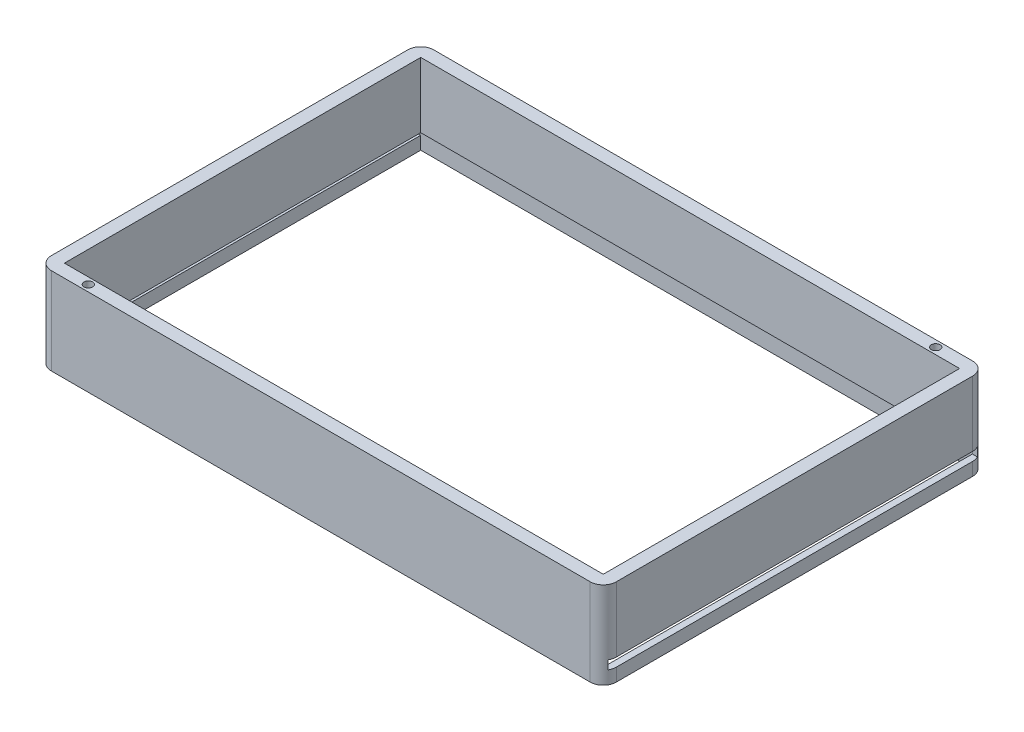
ISO-10303-21;
HEADER;
FILE_DESCRIPTION(('STEP AP214'),'2;1');
FILE_NAME('part.step','',(''),(''),'','','');
FILE_SCHEMA(('AUTOMOTIVE_DESIGN { 1 0 10303 214 1 1 1 1 }'));
ENDSEC;
DATA;
#1=APPLICATION_CONTEXT('core data for automotive mechanical design processes');
#2=APPLICATION_PROTOCOL_DEFINITION('international standard','automotive_design',2000,#1);
#3=PRODUCT_CONTEXT('',#1,'mechanical');
#4=PRODUCT('Part','Part','',(#3));
#5=PRODUCT_RELATED_PRODUCT_CATEGORY('part','',(#4));
#6=PRODUCT_DEFINITION_FORMATION('','',#4);
#7=PRODUCT_DEFINITION_CONTEXT('part definition',#1,'design');
#8=PRODUCT_DEFINITION('design','',#6,#7);
#9=PRODUCT_DEFINITION_SHAPE('','',#8);
#10=(LENGTH_UNIT() NAMED_UNIT(*) SI_UNIT(.MILLI.,.METRE.));
#11=(NAMED_UNIT(*) PLANE_ANGLE_UNIT() SI_UNIT($,.RADIAN.));
#12=(NAMED_UNIT(*) SI_UNIT($,.STERADIAN.) SOLID_ANGLE_UNIT());
#13=UNCERTAINTY_MEASURE_WITH_UNIT(LENGTH_MEASURE(1.E-05),#10,'distance_accuracy_value','');
#14=(GEOMETRIC_REPRESENTATION_CONTEXT(3) GLOBAL_UNCERTAINTY_ASSIGNED_CONTEXT((#13)) GLOBAL_UNIT_ASSIGNED_CONTEXT((#10,
#11,#12)) REPRESENTATION_CONTEXT('',''));
#15=CARTESIAN_POINT('',(0.,0.,0.));
#16=DIRECTION('',(0.,0.,1.));
#17=DIRECTION('',(1.,0.,0.));
#18=AXIS2_PLACEMENT_3D('',#15,#16,#17);
#19=CARTESIAN_POINT('',(130.,20.0000000000001,-3.00000000000002));
#20=DIRECTION('',(-1.,0.,0.));
#21=DIRECTION('',(0.,0.,1.));
#22=AXIS2_PLACEMENT_3D('',#19,#20,#21);
#23=PLANE('',#22);
#24=DIRECTION('',(0.,0.,-1.));
#25=VECTOR('',#24,1.);
#26=CARTESIAN_POINT('',(130.,2.98767595815253,-3.00000000000002));
#27=LINE('',#26,#25);
#28=CARTESIAN_POINT('',(130.,2.98767595815253,-3.00000000000002));
#29=VERTEX_POINT('',#28);
#30=CARTESIAN_POINT('',(130.,2.98767595815252,-85.));
#31=VERTEX_POINT('',#30);
#32=EDGE_CURVE('E570',#29,#31,#27,.T.);
#33=ORIENTED_EDGE('',*,*,#32,.F.);
#34=DIRECTION('',(0.,-1.,0.));
#35=VECTOR('',#34,1.);
#36=CARTESIAN_POINT('',(130.,20.0000000000001,-3.00000000000002));
#37=LINE('',#36,#35);
#38=CARTESIAN_POINT('',(130.,0.,-3.00000000000002));
#39=VERTEX_POINT('',#38);
#40=EDGE_CURVE('E452',#29,#39,#37,.T.);
#41=ORIENTED_EDGE('',*,*,#40,.T.);
#42=DIRECTION('',(0.,0.,-1.));
#43=VECTOR('',#42,1.);
#44=CARTESIAN_POINT('',(130.,0.,-3.00000000000002));
#45=LINE('',#44,#43);
#46=CARTESIAN_POINT('',(130.,0.,-85.));
#47=VERTEX_POINT('',#46);
#48=EDGE_CURVE('E425',#39,#47,#45,.T.);
#49=ORIENTED_EDGE('',*,*,#48,.T.);
#50=DIRECTION('',(0.,-1.,0.));
#51=VECTOR('',#50,1.);
#52=CARTESIAN_POINT('',(130.,20.0000000000001,-85.));
#53=LINE('',#52,#51);
#54=EDGE_CURVE('E450',#31,#47,#53,.T.);
#55=ORIENTED_EDGE('',*,*,#54,.F.);
#56=EDGE_LOOP('',(#33,#41,#49,#55));
#57=FACE_BOUND('',#56,.T.);
#58=ADVANCED_FACE('F32',(#57),#23,.F.);
#59=CARTESIAN_POINT('',(0.,20.0000000000001,-3.00000000000002));
#60=DIRECTION('',(1.,0.,0.));
#61=DIRECTION('',(0.,0.,-1.));
#62=AXIS2_PLACEMENT_3D('',#59,#60,#61);
#63=PLANE('',#62);
#64=DIRECTION('',(0.,0.,-1.));
#65=VECTOR('',#64,1.);
#66=CARTESIAN_POINT('',(0.,2.98767595815253,-1.49220309670284));
#67=LINE('',#66,#65);
#68=CARTESIAN_POINT('',(0.,2.98767595815253,-3.00000000000002));
#69=VERTEX_POINT('',#68);
#70=CARTESIAN_POINT('',(0.,2.98767595815252,-85.));
#71=VERTEX_POINT('',#70);
#72=EDGE_CURVE('E526',#69,#71,#67,.T.);
#73=ORIENTED_EDGE('',*,*,#72,.T.);
#74=DIRECTION('',(0.,-1.,0.));
#75=VECTOR('',#74,1.);
#76=CARTESIAN_POINT('',(0.,20.0000000000001,-85.));
#77=LINE('',#76,#75);
#78=CARTESIAN_POINT('',(0.,0.,-85.));
#79=VERTEX_POINT('',#78);
#80=EDGE_CURVE('E440',#71,#79,#77,.T.);
#81=ORIENTED_EDGE('',*,*,#80,.T.);
#82=DIRECTION('',(0.,0.,1.));
#83=VECTOR('',#82,1.);
#84=CARTESIAN_POINT('',(0.,0.,-3.00000000000002));
#85=LINE('',#84,#83);
#86=CARTESIAN_POINT('',(0.,0.,-3.00000000000002));
#87=VERTEX_POINT('',#86);
#88=EDGE_CURVE('E403',#79,#87,#85,.T.);
#89=ORIENTED_EDGE('',*,*,#88,.T.);
#90=DIRECTION('',(0.,-1.,0.));
#91=VECTOR('',#90,1.);
#92=CARTESIAN_POINT('',(0.,20.0000000000001,-3.00000000000002));
#93=LINE('',#92,#91);
#94=EDGE_CURVE('E417',#69,#87,#93,.T.);
#95=ORIENTED_EDGE('',*,*,#94,.F.);
#96=EDGE_LOOP('',(#73,#81,#89,#95));
#97=FACE_BOUND('',#96,.T.);
#98=ADVANCED_FACE('F562',(#97),#63,.F.);
#99=CARTESIAN_POINT('',(1.5,5.00000000000005,-1.5));
#100=DIRECTION('',(0.,0.,1.));
#101=DIRECTION('',(1.,0.,0.));
#102=AXIS2_PLACEMENT_3D('',#99,#100,#101);
#103=PLANE('',#102);
#104=DIRECTION('',(-1.,0.,0.));
#105=VECTOR('',#104,1.);
#106=CARTESIAN_POINT('',(1.5,2.98767595815253,-1.5));
#107=LINE('',#106,#105);
#108=CARTESIAN_POINT('',(9.,2.98767595815253,-1.5));
#109=VERTEX_POINT('',#108);
#110=CARTESIAN_POINT('',(1.5,2.98767595815253,-1.5));
#111=VERTEX_POINT('',#110);
#112=EDGE_CURVE('E505',#109,#111,#107,.T.);
#113=ORIENTED_EDGE('',*,*,#112,.F.);
#114=DIRECTION('',(0.,-1.,0.));
#115=VECTOR('',#114,1.);
#116=CARTESIAN_POINT('',(9.,20.0000000000001,-1.5));
#117=LINE('',#116,#115);
#118=CARTESIAN_POINT('',(9.,0.,-1.5));
#119=VERTEX_POINT('',#118);
#120=EDGE_CURVE('E469',#109,#119,#117,.T.);
#121=ORIENTED_EDGE('',*,*,#120,.T.);
#122=DIRECTION('',(-1.,0.,0.));
#123=VECTOR('',#122,1.);
#124=CARTESIAN_POINT('',(1.5,0.,-1.5));
#125=LINE('',#124,#123);
#126=CARTESIAN_POINT('',(1.5,0.,-1.5));
#127=VERTEX_POINT('',#126);
#128=EDGE_CURVE('E336',#119,#127,#125,.T.);
#129=ORIENTED_EDGE('',*,*,#128,.T.);
#130=DIRECTION('',(0.,-1.,0.));
#131=VECTOR('',#130,1.);
#132=CARTESIAN_POINT('',(1.5,5.00000000000005,-1.5));
#133=LINE('',#132,#131);
#134=EDGE_CURVE('E342',#111,#127,#133,.T.);
#135=ORIENTED_EDGE('',*,*,#134,.F.);
#136=EDGE_LOOP('',(#113,#121,#129,#135));
#137=FACE_BOUND('',#136,.T.);
#138=ADVANCED_FACE('F620',(#137),#103,.F.);
#139=DIRECTION('',(-1.,0.,0.));
#140=VECTOR('',#139,1.);
#141=CARTESIAN_POINT('',(1.5,2.98767595815253,-1.5));
#142=LINE('',#141,#140);
#143=CARTESIAN_POINT('',(128.5,2.98767595815253,-1.49999999999998));
#144=VERTEX_POINT('',#143);
#145=CARTESIAN_POINT('',(11.,2.98767595815253,-1.5));
#146=VERTEX_POINT('',#145);
#147=EDGE_CURVE('E271',#144,#146,#142,.T.);
#148=ORIENTED_EDGE('',*,*,#147,.F.);
#149=DIRECTION('',(0.,-1.,0.));
#150=VECTOR('',#149,1.);
#151=CARTESIAN_POINT('',(128.5,5.00000000000005,-1.49999999999998));
#152=LINE('',#151,#150);
#153=CARTESIAN_POINT('',(128.5,0.,-1.49999999999998));
#154=VERTEX_POINT('',#153);
#155=EDGE_CURVE('E346',#144,#154,#152,.T.);
#156=ORIENTED_EDGE('',*,*,#155,.T.);
#157=CARTESIAN_POINT('',(11.,0.,-1.5));
#158=VERTEX_POINT('',#157);
#159=EDGE_CURVE('E316',#154,#158,#125,.T.);
#160=ORIENTED_EDGE('',*,*,#159,.T.);
#161=DIRECTION('',(0.,-1.,0.));
#162=VECTOR('',#161,1.);
#163=CARTESIAN_POINT('',(11.,20.0000000000001,-1.5));
#164=LINE('',#163,#162);
#165=EDGE_CURVE('E466',#158,#146,#164,.F.);
#166=ORIENTED_EDGE('',*,*,#165,.T.);
#167=EDGE_LOOP('',(#148,#156,#160,#166));
#168=FACE_BOUND('',#167,.T.);
#169=ADVANCED_FACE('F686',(#168),#103,.F.);
#170=CARTESIAN_POINT('',(3.,20.0000000000001,-3.));
#171=DIRECTION('',(1.,0.,0.));
#172=DIRECTION('',(0.,0.,-1.));
#173=AXIS2_PLACEMENT_3D('',#170,#171,#172);
#174=PLANE('',#173);
#175=DIRECTION('',(0.,-1.,0.));
#176=VECTOR('',#175,1.);
#177=CARTESIAN_POINT('',(3.,20.0000000000001,-3.));
#178=LINE('',#177,#176);
#179=CARTESIAN_POINT('',(3.,20.0000000000001,-3.));
#180=VERTEX_POINT('',#179);
#181=CARTESIAN_POINT('',(3.,5.00000000000005,-3.));
#182=VERTEX_POINT('',#181);
#183=EDGE_CURVE('E395',#180,#182,#178,.T.);
#184=ORIENTED_EDGE('',*,*,#183,.T.);
#185=DIRECTION('',(0.,0.,-1.));
#186=VECTOR('',#185,1.);
#187=CARTESIAN_POINT('',(3.,5.00000000000005,-3.));
#188=LINE('',#187,#186);
#189=CARTESIAN_POINT('',(3.,5.00000000000005,-85.));
#190=VERTEX_POINT('',#189);
#191=EDGE_CURVE('E362',#182,#190,#188,.T.);
#192=ORIENTED_EDGE('',*,*,#191,.T.);
#193=DIRECTION('',(0.,-1.,0.));
#194=VECTOR('',#193,1.);
#195=CARTESIAN_POINT('',(3.,20.0000000000001,-85.));
#196=LINE('',#195,#194);
#197=CARTESIAN_POINT('',(3.,20.0000000000001,-85.));
#198=VERTEX_POINT('',#197);
#199=EDGE_CURVE('E386',#198,#190,#196,.T.);
#200=ORIENTED_EDGE('',*,*,#199,.F.);
#201=DIRECTION('',(0.,0.,1.));
#202=VECTOR('',#201,1.);
#203=CARTESIAN_POINT('',(3.,20.0000000000001,-3.));
#204=LINE('',#203,#202);
#205=EDGE_CURVE('E375',#198,#180,#204,.T.);
#206=ORIENTED_EDGE('',*,*,#205,.T.);
#207=EDGE_LOOP('',(#184,#192,#200,#206));
#208=FACE_BOUND('',#207,.T.);
#209=ADVANCED_FACE('F683',(#208),#174,.T.);
#210=CARTESIAN_POINT('',(3.,20.0000000000001,-3.));
#211=DIRECTION('',(0.,0.,-1.));
#212=DIRECTION('',(-1.,0.,0.));
#213=AXIS2_PLACEMENT_3D('',#210,#211,#212);
#214=PLANE('',#213);
#215=DIRECTION('',(0.,-1.,0.));
#216=VECTOR('',#215,1.);
#217=CARTESIAN_POINT('',(127.,20.0000000000001,-3.));
#218=LINE('',#217,#216);
#219=CARTESIAN_POINT('',(127.,20.0000000000001,-3.));
#220=VERTEX_POINT('',#219);
#221=CARTESIAN_POINT('',(127.,5.00000000000005,-3.));
#222=VERTEX_POINT('',#221);
#223=EDGE_CURVE('E392',#220,#222,#218,.T.);
#224=ORIENTED_EDGE('',*,*,#223,.T.);
#225=DIRECTION('',(-1.,0.,0.));
#226=VECTOR('',#225,1.);
#227=CARTESIAN_POINT('',(3.,5.00000000000005,-3.));
#228=LINE('',#227,#226);
#229=EDGE_CURVE('E359',#222,#182,#228,.T.);
#230=ORIENTED_EDGE('',*,*,#229,.T.);
#231=ORIENTED_EDGE('',*,*,#183,.F.);
#232=DIRECTION('',(1.,0.,0.));
#233=VECTOR('',#232,1.);
#234=CARTESIAN_POINT('',(3.,20.0000000000001,-3.));
#235=LINE('',#234,#233);
#236=EDGE_CURVE('E379',#180,#220,#235,.T.);
#237=ORIENTED_EDGE('',*,*,#236,.T.);
#238=EDGE_LOOP('',(#224,#230,#231,#237));
#239=FACE_BOUND('',#238,.T.);
#240=ADVANCED_FACE('F680',(#239),#214,.T.);
#241=CARTESIAN_POINT('',(127.,20.0000000000001,-3.));
#242=DIRECTION('',(-1.,0.,0.));
#243=DIRECTION('',(0.,0.,1.));
#244=AXIS2_PLACEMENT_3D('',#241,#242,#243);
#245=PLANE('',#244);
#246=DIRECTION('',(0.,-1.,0.));
#247=VECTOR('',#246,1.);
#248=CARTESIAN_POINT('',(127.,20.0000000000001,-85.));
#249=LINE('',#248,#247);
#250=CARTESIAN_POINT('',(127.,20.0000000000001,-85.));
#251=VERTEX_POINT('',#250);
#252=CARTESIAN_POINT('',(127.,5.00000000000005,-85.));
#253=VERTEX_POINT('',#252);
#254=EDGE_CURVE('E389',#251,#253,#249,.T.);
#255=ORIENTED_EDGE('',*,*,#254,.T.);
#256=DIRECTION('',(0.,0.,1.));
#257=VECTOR('',#256,1.);
#258=CARTESIAN_POINT('',(127.,5.00000000000005,-3.));
#259=LINE('',#258,#257);
#260=EDGE_CURVE('E356',#253,#222,#259,.T.);
#261=ORIENTED_EDGE('',*,*,#260,.T.);
#262=ORIENTED_EDGE('',*,*,#223,.F.);
#263=DIRECTION('',(0.,0.,-1.));
#264=VECTOR('',#263,1.);
#265=CARTESIAN_POINT('',(127.,20.0000000000001,-3.));
#266=LINE('',#265,#264);
#267=EDGE_CURVE('E381',#220,#251,#266,.T.);
#268=ORIENTED_EDGE('',*,*,#267,.T.);
#269=EDGE_LOOP('',(#255,#261,#262,#268));
#270=FACE_BOUND('',#269,.T.);
#271=ADVANCED_FACE('F676',(#270),#245,.T.);
#272=CARTESIAN_POINT('',(3.,20.0000000000001,-85.));
#273=DIRECTION('',(0.,0.,1.));
#274=DIRECTION('',(1.,0.,0.));
#275=AXIS2_PLACEMENT_3D('',#272,#273,#274);
#276=PLANE('',#275);
#277=ORIENTED_EDGE('',*,*,#199,.T.);
#278=DIRECTION('',(1.,0.,0.));
#279=VECTOR('',#278,1.);
#280=CARTESIAN_POINT('',(3.,5.00000000000005,-85.));
#281=LINE('',#280,#279);
#282=EDGE_CURVE('E353',#190,#253,#281,.T.);
#283=ORIENTED_EDGE('',*,*,#282,.T.);
#284=ORIENTED_EDGE('',*,*,#254,.F.);
#285=DIRECTION('',(-1.,0.,0.));
#286=VECTOR('',#285,1.);
#287=CARTESIAN_POINT('',(3.,20.0000000000001,-85.));
#288=LINE('',#287,#286);
#289=EDGE_CURVE('E384',#251,#198,#288,.T.);
#290=ORIENTED_EDGE('',*,*,#289,.T.);
#291=EDGE_LOOP('',(#277,#283,#284,#290));
#292=FACE_BOUND('',#291,.T.);
#293=ADVANCED_FACE('F654',(#292),#276,.T.);
#294=CARTESIAN_POINT('',(3.,20.0000000000001,-3.));
#295=DIRECTION('',(0.,-1.,0.));
#296=DIRECTION('',(0.,0.,-1.));
#297=AXIS2_PLACEMENT_3D('',#294,#295,#296);
#298=PLANE('',#297);
#299=CARTESIAN_POINT('',(3.,20.0000000000001,-3.));
#300=DIRECTION('',(0.,1.,0.));
#301=DIRECTION('',(0.,0.,-1.));
#302=AXIS2_PLACEMENT_3D('',#299,#300,#301);
#303=CIRCLE('',#302,3.);
#304=CARTESIAN_POINT('',(0.,20.0000000000001,-3.00000000000002));
#305=VERTEX_POINT('',#304);
#306=CARTESIAN_POINT('',(3.00000000000002,20.0000000000001,0.));
#307=VERTEX_POINT('',#306);
#308=EDGE_CURVE('E399',#305,#307,#303,.T.);
#309=ORIENTED_EDGE('',*,*,#308,.T.);
#310=DIRECTION('',(1.,0.,0.));
#311=VECTOR('',#310,1.);
#312=CARTESIAN_POINT('',(3.00000000000002,20.0000000000001,0.));
#313=LINE('',#312,#311);
#314=CARTESIAN_POINT('',(127.,20.0000000000001,0.));
#315=VERTEX_POINT('',#314);
#316=EDGE_CURVE('E402',#307,#315,#313,.T.);
#317=ORIENTED_EDGE('',*,*,#316,.T.);
#318=CARTESIAN_POINT('',(127.,20.0000000000001,-3.));
#319=DIRECTION('',(0.,1.,0.));
#320=DIRECTION('',(0.,0.,1.));
#321=AXIS2_PLACEMENT_3D('',#318,#319,#320);
#322=CIRCLE('',#321,3.);
#323=CARTESIAN_POINT('',(130.,20.0000000000001,-3.00000000000002));
#324=VERTEX_POINT('',#323);
#325=EDGE_CURVE('E405',#315,#324,#322,.T.);
#326=ORIENTED_EDGE('',*,*,#325,.T.);
#327=DIRECTION('',(0.,0.,-1.));
#328=VECTOR('',#327,1.);
#329=CARTESIAN_POINT('',(130.,20.0000000000001,-3.00000000000002));
#330=LINE('',#329,#328);
#331=CARTESIAN_POINT('',(130.,20.0000000000001,-85.));
#332=VERTEX_POINT('',#331);
#333=EDGE_CURVE('E407',#324,#332,#330,.T.);
#334=ORIENTED_EDGE('',*,*,#333,.T.);
#335=CARTESIAN_POINT('',(127.,20.0000000000001,-85.));
#336=DIRECTION('',(0.,1.,0.));
#337=DIRECTION('',(0.,0.,-1.));
#338=AXIS2_PLACEMENT_3D('',#335,#336,#337);
#339=CIRCLE('',#338,3.);
#340=CARTESIAN_POINT('',(127.,20.0000000000001,-88.));
#341=VERTEX_POINT('',#340);
#342=EDGE_CURVE('E409',#332,#341,#339,.T.);
#343=ORIENTED_EDGE('',*,*,#342,.T.);
#344=DIRECTION('',(-1.,0.,0.));
#345=VECTOR('',#344,1.);
#346=CARTESIAN_POINT('',(3.00000000000002,20.0000000000001,-88.));
#347=LINE('',#346,#345);
#348=CARTESIAN_POINT('',(3.00000000000002,20.0000000000001,-88.));
#349=VERTEX_POINT('',#348);
#350=EDGE_CURVE('E411',#341,#349,#347,.T.);
#351=ORIENTED_EDGE('',*,*,#350,.T.);
#352=CARTESIAN_POINT('',(3.,20.0000000000001,-85.));
#353=DIRECTION('',(0.,1.,0.));
#354=DIRECTION('',(0.,0.,-1.));
#355=AXIS2_PLACEMENT_3D('',#352,#353,#354);
#356=CIRCLE('',#355,3.);
#357=CARTESIAN_POINT('',(0.,20.0000000000001,-85.));
#358=VERTEX_POINT('',#357);
#359=EDGE_CURVE('E413',#349,#358,#356,.T.);
#360=ORIENTED_EDGE('',*,*,#359,.T.);
#361=DIRECTION('',(0.,0.,1.));
#362=VECTOR('',#361,1.);
#363=CARTESIAN_POINT('',(0.,20.0000000000001,-3.00000000000002));
#364=LINE('',#363,#362);
#365=EDGE_CURVE('E415',#358,#305,#364,.T.);
#366=ORIENTED_EDGE('',*,*,#365,.T.);
#367=EDGE_LOOP('',(#309,#317,#326,#334,#343,#351,#360,#366));
#368=FACE_BOUND('',#367,.T.);
#369=ORIENTED_EDGE('',*,*,#205,.F.);
#370=ORIENTED_EDGE('',*,*,#289,.F.);
#371=ORIENTED_EDGE('',*,*,#267,.F.);
#372=ORIENTED_EDGE('',*,*,#236,.F.);
#373=EDGE_LOOP('',(#369,#370,#371,#372));
#374=FACE_BOUND('',#373,.T.);
#375=CARTESIAN_POINT('',(120.,20.0000000000001,-86.5));
#376=DIRECTION('',(0.,1.,0.));
#377=DIRECTION('',(0.,0.,1.));
#378=AXIS2_PLACEMENT_3D('',#375,#376,#377);
#379=CIRCLE('',#378,0.999999999999998);
#380=CARTESIAN_POINT('',(120.,20.0000000000001,-85.5));
#381=VERTEX_POINT('',#380);
#382=EDGE_CURVE('E372',#381,#381,#379,.T.);
#383=ORIENTED_EDGE('',*,*,#382,.F.);
#384=EDGE_LOOP('',(#383));
#385=FACE_BOUND('',#384,.T.);
#386=CARTESIAN_POINT('',(10.,20.0000000000001,-1.5));
#387=DIRECTION('',(0.,1.,0.));
#388=DIRECTION('',(0.,0.,1.));
#389=AXIS2_PLACEMENT_3D('',#386,#387,#388);
#390=CIRCLE('',#389,1.);
#391=CARTESIAN_POINT('',(10.,20.0000000000001,-0.499999999999999));
#392=VERTEX_POINT('',#391);
#393=EDGE_CURVE('E366',#392,#392,#390,.T.);
#394=ORIENTED_EDGE('',*,*,#393,.F.);
#395=EDGE_LOOP('',(#394));
#396=FACE_BOUND('',#395,.T.);
#397=ADVANCED_FACE('F546',(#368,#374,#385,#396),#298,.F.);
#398=CARTESIAN_POINT('',(3.,0.,-3.));
#399=DIRECTION('',(0.,-1.,0.));
#400=DIRECTION('',(0.,0.,-1.));
#401=AXIS2_PLACEMENT_3D('',#398,#399,#400);
#402=PLANE('',#401);
#403=ORIENTED_EDGE('',*,*,#128,.F.);
#404=CARTESIAN_POINT('',(10.,0.,-1.5));
#405=DIRECTION('',(0.,1.,0.));
#406=DIRECTION('',(0.,0.,1.));
#407=AXIS2_PLACEMENT_3D('',#404,#405,#406);
#408=CIRCLE('',#407,1.);
#409=EDGE_CURVE('E365',#119,#158,#408,.T.);
#410=ORIENTED_EDGE('',*,*,#409,.T.);
#411=ORIENTED_EDGE('',*,*,#159,.F.);
#412=DIRECTION('',(0.,0.,1.));
#413=VECTOR('',#412,1.);
#414=CARTESIAN_POINT('',(128.5,0.,-1.49999999999998));
#415=LINE('',#414,#413);
#416=CARTESIAN_POINT('',(128.5,0.,-86.5));
#417=VERTEX_POINT('',#416);
#418=EDGE_CURVE('E333',#417,#154,#415,.T.);
#419=ORIENTED_EDGE('',*,*,#418,.F.);
#420=DIRECTION('',(1.,0.,0.));
#421=VECTOR('',#420,1.);
#422=CARTESIAN_POINT('',(1.5,0.,-86.5));
#423=LINE('',#422,#421);
#424=CARTESIAN_POINT('',(121.,0.,-86.5));
#425=VERTEX_POINT('',#424);
#426=EDGE_CURVE('E330',#425,#417,#423,.T.);
#427=ORIENTED_EDGE('',*,*,#426,.F.);
#428=CARTESIAN_POINT('',(120.,0.,-86.5));
#429=DIRECTION('',(0.,1.,0.));
#430=DIRECTION('',(0.,0.,1.));
#431=AXIS2_PLACEMENT_3D('',#428,#429,#430);
#432=CIRCLE('',#431,0.999999999999998);
#433=CARTESIAN_POINT('',(119.,0.,-86.5));
#434=VERTEX_POINT('',#433);
#435=EDGE_CURVE('E369',#425,#434,#432,.T.);
#436=ORIENTED_EDGE('',*,*,#435,.T.);
#437=CARTESIAN_POINT('',(1.5,0.,-86.5));
#438=VERTEX_POINT('',#437);
#439=EDGE_CURVE('E331',#438,#434,#423,.T.);
#440=ORIENTED_EDGE('',*,*,#439,.F.);
#441=DIRECTION('',(0.,0.,-1.));
#442=VECTOR('',#441,1.);
#443=CARTESIAN_POINT('',(1.5,0.,-1.5));
#444=LINE('',#443,#442);
#445=EDGE_CURVE('E311',#127,#438,#444,.T.);
#446=ORIENTED_EDGE('',*,*,#445,.F.);
#447=EDGE_LOOP('',(#403,#410,#411,#419,#427,#436,#440,#446));
#448=FACE_BOUND('',#447,.T.);
#449=CARTESIAN_POINT('',(3.,0.,-3.));
#450=DIRECTION('',(0.,1.,0.));
#451=DIRECTION('',(0.,0.,-1.));
#452=AXIS2_PLACEMENT_3D('',#449,#450,#451);
#453=CIRCLE('',#452,3.);
#454=CARTESIAN_POINT('',(3.00000000000002,0.,0.));
#455=VERTEX_POINT('',#454);
#456=EDGE_CURVE('E398',#87,#455,#453,.T.);
#457=ORIENTED_EDGE('',*,*,#456,.F.);
#458=ORIENTED_EDGE('',*,*,#88,.F.);
#459=CARTESIAN_POINT('',(3.,0.,-85.));
#460=DIRECTION('',(0.,1.,0.));
#461=DIRECTION('',(0.,0.,-1.));
#462=AXIS2_PLACEMENT_3D('',#459,#460,#461);
#463=CIRCLE('',#462,3.);
#464=CARTESIAN_POINT('',(3.00000000000002,0.,-88.));
#465=VERTEX_POINT('',#464);
#466=EDGE_CURVE('E432',#465,#79,#463,.T.);
#467=ORIENTED_EDGE('',*,*,#466,.F.);
#468=DIRECTION('',(-1.,0.,0.));
#469=VECTOR('',#468,1.);
#470=CARTESIAN_POINT('',(3.00000000000002,0.,-88.));
#471=LINE('',#470,#469);
#472=CARTESIAN_POINT('',(127.,0.,-88.));
#473=VERTEX_POINT('',#472);
#474=EDGE_CURVE('E430',#473,#465,#471,.T.);
#475=ORIENTED_EDGE('',*,*,#474,.F.);
#476=CARTESIAN_POINT('',(127.,0.,-85.));
#477=DIRECTION('',(0.,1.,0.));
#478=DIRECTION('',(0.,0.,-1.));
#479=AXIS2_PLACEMENT_3D('',#476,#477,#478);
#480=CIRCLE('',#479,3.);
#481=EDGE_CURVE('E428',#47,#473,#480,.T.);
#482=ORIENTED_EDGE('',*,*,#481,.F.);
#483=ORIENTED_EDGE('',*,*,#48,.F.);
#484=CARTESIAN_POINT('',(127.,0.,-3.));
#485=DIRECTION('',(0.,1.,0.));
#486=DIRECTION('',(0.,0.,1.));
#487=AXIS2_PLACEMENT_3D('',#484,#485,#486);
#488=CIRCLE('',#487,3.);
#489=CARTESIAN_POINT('',(127.,0.,0.));
#490=VERTEX_POINT('',#489);
#491=EDGE_CURVE('E422',#490,#39,#488,.T.);
#492=ORIENTED_EDGE('',*,*,#491,.F.);
#493=DIRECTION('',(1.,0.,0.));
#494=VECTOR('',#493,1.);
#495=CARTESIAN_POINT('',(3.00000000000002,0.,0.));
#496=LINE('',#495,#494);
#497=EDGE_CURVE('E420',#455,#490,#496,.T.);
#498=ORIENTED_EDGE('',*,*,#497,.F.);
#499=EDGE_LOOP('',(#457,#458,#467,#475,#482,#483,#492,#498));
#500=FACE_BOUND('',#499,.T.);
#501=ADVANCED_FACE('F558',(#448,#500),#402,.T.);
#502=CARTESIAN_POINT('',(3.,20.0000000000001,-3.));
#503=DIRECTION('',(0.,-1.,0.));
#504=DIRECTION('',(0.,0.,-1.));
#505=AXIS2_PLACEMENT_3D('',#502,#503,#504);
#506=CYLINDRICAL_SURFACE('',#505,3.);
#507=CARTESIAN_POINT('',(0.,4.98767595815252,-3.00000000000002));
#508=VERTEX_POINT('',#507);
#509=EDGE_CURVE('E437',#305,#508,#93,.T.);
#510=ORIENTED_EDGE('',*,*,#509,.T.);
#511=CARTESIAN_POINT('',(3.,4.98767595815252,-3.));
#512=DIRECTION('',(0.,1.,0.));
#513=DIRECTION('',(0.,0.,1.));
#514=AXIS2_PLACEMENT_3D('',#511,#512,#513);
#515=CIRCLE('',#514,3.);
#516=CARTESIAN_POINT('',(0.406440959143689,4.98767595815252,-1.49220309670284));
#517=VERTEX_POINT('',#516);
#518=EDGE_CURVE('E302',#508,#517,#515,.T.);
#519=ORIENTED_EDGE('',*,*,#518,.T.);
#520=DIRECTION('',(0.,-1.,0.));
#521=VECTOR('',#520,1.);
#522=CARTESIAN_POINT('',(0.406440959143692,20.0000000000001,-1.49220309670284));
#523=LINE('',#522,#521);
#524=CARTESIAN_POINT('',(0.406440959143692,2.98767595815253,-1.49220309670284));
#525=VERTEX_POINT('',#524);
#526=EDGE_CURVE('E308',#517,#525,#523,.T.);
#527=ORIENTED_EDGE('',*,*,#526,.T.);
#528=CARTESIAN_POINT('',(3.,2.98767595815253,-3.));
#529=DIRECTION('',(0.,1.,0.));
#530=DIRECTION('',(0.,0.,1.));
#531=AXIS2_PLACEMENT_3D('',#528,#529,#530);
#532=CIRCLE('',#531,3.);
#533=EDGE_CURVE('E497',#69,#525,#532,.T.);
#534=ORIENTED_EDGE('',*,*,#533,.F.);
#535=ORIENTED_EDGE('',*,*,#94,.T.);
#536=ORIENTED_EDGE('',*,*,#456,.T.);
#537=DIRECTION('',(0.,-1.,0.));
#538=VECTOR('',#537,1.);
#539=CARTESIAN_POINT('',(3.00000000000002,20.0000000000001,0.));
#540=LINE('',#539,#538);
#541=EDGE_CURVE('E459',#307,#455,#540,.T.);
#542=ORIENTED_EDGE('',*,*,#541,.F.);
#543=ORIENTED_EDGE('',*,*,#308,.F.);
#544=EDGE_LOOP('',(#510,#519,#527,#534,#535,#536,#542,#543));
#545=FACE_BOUND('',#544,.T.);
#546=ADVANCED_FACE('F34',(#545),#506,.T.);
#547=CARTESIAN_POINT('',(3.00000000000002,20.0000000000001,0.));
#548=DIRECTION('',(0.,0.,-1.));
#549=DIRECTION('',(-1.,0.,0.));
#550=AXIS2_PLACEMENT_3D('',#547,#548,#549);
#551=PLANE('',#550);
#552=ORIENTED_EDGE('',*,*,#497,.T.);
#553=DIRECTION('',(0.,-1.,0.));
#554=VECTOR('',#553,1.);
#555=CARTESIAN_POINT('',(127.,20.0000000000001,0.));
#556=LINE('',#555,#554);
#557=EDGE_CURVE('E456',#315,#490,#556,.T.);
#558=ORIENTED_EDGE('',*,*,#557,.F.);
#559=ORIENTED_EDGE('',*,*,#316,.F.);
#560=ORIENTED_EDGE('',*,*,#541,.T.);
#561=EDGE_LOOP('',(#552,#558,#559,#560));
#562=FACE_BOUND('',#561,.T.);
#563=ADVANCED_FACE('F629',(#562),#551,.F.);
#564=CARTESIAN_POINT('',(127.,20.0000000000001,-3.));
#565=DIRECTION('',(0.,-1.,0.));
#566=DIRECTION('',(0.,0.,-1.));
#567=AXIS2_PLACEMENT_3D('',#564,#565,#566);
#568=CYLINDRICAL_SURFACE('',#567,3.);
#569=DIRECTION('',(0.,-1.,0.));
#570=VECTOR('',#569,1.);
#571=CARTESIAN_POINT('',(129.593559040856,20.0000000000001,-1.49220309670284));
#572=LINE('',#571,#570);
#573=CARTESIAN_POINT('',(129.593559040856,2.98767595815253,-1.49220309670284));
#574=VERTEX_POINT('',#573);
#575=CARTESIAN_POINT('',(129.593559040856,4.98767595815252,-1.49220309670284));
#576=VERTEX_POINT('',#575);
#577=EDGE_CURVE('E305',#574,#576,#572,.F.);
#578=ORIENTED_EDGE('',*,*,#577,.T.);
#579=CARTESIAN_POINT('',(127.,4.98767595815252,-3.));
#580=DIRECTION('',(0.,1.,0.));
#581=DIRECTION('',(0.,0.,1.));
#582=AXIS2_PLACEMENT_3D('',#579,#580,#581);
#583=CIRCLE('',#582,3.);
#584=CARTESIAN_POINT('',(130.,4.98767595815252,-3.00000000000002));
#585=VERTEX_POINT('',#584);
#586=EDGE_CURVE('E293',#576,#585,#583,.T.);
#587=ORIENTED_EDGE('',*,*,#586,.T.);
#588=EDGE_CURVE('E453',#324,#585,#37,.T.);
#589=ORIENTED_EDGE('',*,*,#588,.F.);
#590=ORIENTED_EDGE('',*,*,#325,.F.);
#591=ORIENTED_EDGE('',*,*,#557,.T.);
#592=ORIENTED_EDGE('',*,*,#491,.T.);
#593=ORIENTED_EDGE('',*,*,#40,.F.);
#594=CARTESIAN_POINT('',(127.,2.98767595815253,-3.));
#595=DIRECTION('',(0.,1.,0.));
#596=DIRECTION('',(0.,0.,1.));
#597=AXIS2_PLACEMENT_3D('',#594,#595,#596);
#598=CIRCLE('',#597,3.);
#599=EDGE_CURVE('E565',#574,#29,#598,.T.);
#600=ORIENTED_EDGE('',*,*,#599,.F.);
#601=EDGE_LOOP('',(#578,#587,#589,#590,#591,#592,#593,#600));
#602=FACE_BOUND('',#601,.T.);
#603=ADVANCED_FACE('F624',(#602),#568,.T.);
#604=ORIENTED_EDGE('',*,*,#588,.T.);
#605=DIRECTION('',(0.,0.,-1.));
#606=VECTOR('',#605,1.);
#607=CARTESIAN_POINT('',(130.,4.98767595815252,-3.00000000000002));
#608=LINE('',#607,#606);
#609=CARTESIAN_POINT('',(130.,4.98767595815251,-85.));
#610=VERTEX_POINT('',#609);
#611=EDGE_CURVE('E290',#585,#610,#608,.T.);
#612=ORIENTED_EDGE('',*,*,#611,.T.);
#613=EDGE_CURVE('E289',#332,#610,#53,.T.);
#614=ORIENTED_EDGE('',*,*,#613,.F.);
#615=ORIENTED_EDGE('',*,*,#333,.F.);
#616=EDGE_LOOP('',(#604,#612,#614,#615));
#617=FACE_BOUND('',#616,.T.);
#618=ADVANCED_FACE('F613',(#617),#23,.F.);
#619=CARTESIAN_POINT('',(127.,20.0000000000001,-85.));
#620=DIRECTION('',(0.,-1.,0.));
#621=DIRECTION('',(0.,0.,-1.));
#622=AXIS2_PLACEMENT_3D('',#619,#620,#621);
#623=CYLINDRICAL_SURFACE('',#622,3.);
#624=ORIENTED_EDGE('',*,*,#613,.T.);
#625=CARTESIAN_POINT('',(127.,4.98767595815251,-85.));
#626=DIRECTION('',(0.,1.,0.));
#627=DIRECTION('',(0.,0.,1.));
#628=AXIS2_PLACEMENT_3D('',#625,#626,#627);
#629=CIRCLE('',#628,3.);
#630=CARTESIAN_POINT('',(129.631131478068,4.98767595815251,-86.4412311213405));
#631=VERTEX_POINT('',#630);
#632=EDGE_CURVE('E277',#610,#631,#629,.T.);
#633=ORIENTED_EDGE('',*,*,#632,.T.);
#634=DIRECTION('',(0.,-1.,0.));
#635=VECTOR('',#634,1.);
#636=CARTESIAN_POINT('',(129.631131478068,20.0000000000001,-86.4412311213405));
#637=LINE('',#636,#635);
#638=CARTESIAN_POINT('',(129.631131478068,2.98767595815252,-86.4412311213405));
#639=VERTEX_POINT('',#638);
#640=EDGE_CURVE('E263',#639,#631,#637,.F.);
#641=ORIENTED_EDGE('',*,*,#640,.F.);
#642=CARTESIAN_POINT('',(127.,2.98767595815252,-85.));
#643=DIRECTION('',(0.,1.,0.));
#644=DIRECTION('',(0.,0.,1.));
#645=AXIS2_PLACEMENT_3D('',#642,#643,#644);
#646=CIRCLE('',#645,3.);
#647=EDGE_CURVE('E508',#31,#639,#646,.T.);
#648=ORIENTED_EDGE('',*,*,#647,.F.);
#649=ORIENTED_EDGE('',*,*,#54,.T.);
#650=ORIENTED_EDGE('',*,*,#481,.T.);
#651=DIRECTION('',(0.,-1.,0.));
#652=VECTOR('',#651,1.);
#653=CARTESIAN_POINT('',(127.,20.0000000000001,-88.));
#654=LINE('',#653,#652);
#655=EDGE_CURVE('E447',#341,#473,#654,.T.);
#656=ORIENTED_EDGE('',*,*,#655,.F.);
#657=ORIENTED_EDGE('',*,*,#342,.F.);
#658=EDGE_LOOP('',(#624,#633,#641,#648,#649,#650,#656,#657));
#659=FACE_BOUND('',#658,.T.);
#660=ADVANCED_FACE('F286',(#659),#623,.T.);
#661=CARTESIAN_POINT('',(3.00000000000002,20.0000000000001,-88.));
#662=DIRECTION('',(0.,0.,1.));
#663=DIRECTION('',(1.,0.,0.));
#664=AXIS2_PLACEMENT_3D('',#661,#662,#663);
#665=PLANE('',#664);
#666=ORIENTED_EDGE('',*,*,#474,.T.);
#667=DIRECTION('',(0.,-1.,0.));
#668=VECTOR('',#667,1.);
#669=CARTESIAN_POINT('',(3.00000000000002,20.0000000000001,-88.));
#670=LINE('',#669,#668);
#671=EDGE_CURVE('E444',#349,#465,#670,.T.);
#672=ORIENTED_EDGE('',*,*,#671,.F.);
#673=ORIENTED_EDGE('',*,*,#350,.F.);
#674=ORIENTED_EDGE('',*,*,#655,.T.);
#675=EDGE_LOOP('',(#666,#672,#673,#674));
#676=FACE_BOUND('',#675,.T.);
#677=ADVANCED_FACE('F605',(#676),#665,.F.);
#678=CARTESIAN_POINT('',(3.,20.0000000000001,-85.));
#679=DIRECTION('',(0.,-1.,0.));
#680=DIRECTION('',(0.,0.,-1.));
#681=AXIS2_PLACEMENT_3D('',#678,#679,#680);
#682=CYLINDRICAL_SURFACE('',#681,3.);
#683=DIRECTION('',(0.,-1.,0.));
#684=VECTOR('',#683,1.);
#685=CARTESIAN_POINT('',(0.368868521932127,20.0000000000001,-86.4412311213405));
#686=LINE('',#685,#684);
#687=CARTESIAN_POINT('',(0.368868521932131,4.98767595815251,-86.4412311213405));
#688=VERTEX_POINT('',#687);
#689=CARTESIAN_POINT('',(0.368868521932131,2.98767595815252,-86.4412311213405));
#690=VERTEX_POINT('',#689);
#691=EDGE_CURVE('E272',#688,#690,#686,.T.);
#692=ORIENTED_EDGE('',*,*,#691,.F.);
#693=CARTESIAN_POINT('',(3.,4.98767595815251,-85.));
#694=DIRECTION('',(0.,1.,0.));
#695=DIRECTION('',(0.,0.,1.));
#696=AXIS2_PLACEMENT_3D('',#693,#694,#695);
#697=CIRCLE('',#696,3.);
#698=CARTESIAN_POINT('',(0.,4.98767595815251,-85.));
#699=VERTEX_POINT('',#698);
#700=EDGE_CURVE('E291',#688,#699,#697,.T.);
#701=ORIENTED_EDGE('',*,*,#700,.T.);
#702=EDGE_CURVE('E441',#358,#699,#77,.T.);
#703=ORIENTED_EDGE('',*,*,#702,.F.);
#704=ORIENTED_EDGE('',*,*,#359,.F.);
#705=ORIENTED_EDGE('',*,*,#671,.T.);
#706=ORIENTED_EDGE('',*,*,#466,.T.);
#707=ORIENTED_EDGE('',*,*,#80,.F.);
#708=CARTESIAN_POINT('',(3.,2.98767595815252,-85.));
#709=DIRECTION('',(0.,1.,0.));
#710=DIRECTION('',(0.,0.,1.));
#711=AXIS2_PLACEMENT_3D('',#708,#709,#710);
#712=CIRCLE('',#711,3.);
#713=EDGE_CURVE('E55',#690,#71,#712,.T.);
#714=ORIENTED_EDGE('',*,*,#713,.F.);
#715=EDGE_LOOP('',(#692,#701,#703,#704,#705,#706,#707,#714));
#716=FACE_BOUND('',#715,.T.);
#717=ADVANCED_FACE('F540',(#716),#682,.T.);
#718=ORIENTED_EDGE('',*,*,#702,.T.);
#719=DIRECTION('',(0.,0.,-1.));
#720=VECTOR('',#719,1.);
#721=CARTESIAN_POINT('',(0.,4.98767595815252,-1.49220309670284));
#722=LINE('',#721,#720);
#723=EDGE_CURVE('E530',#508,#699,#722,.T.);
#724=ORIENTED_EDGE('',*,*,#723,.F.);
#725=ORIENTED_EDGE('',*,*,#509,.F.);
#726=ORIENTED_EDGE('',*,*,#365,.F.);
#727=EDGE_LOOP('',(#718,#724,#725,#726));
#728=FACE_BOUND('',#727,.T.);
#729=ADVANCED_FACE('F543',(#728),#63,.F.);
#730=CARTESIAN_POINT('',(120.,20.0000000000001,-86.5));
#731=DIRECTION('',(0.,-1.,0.));
#732=DIRECTION('',(0.,0.,-1.));
#733=AXIS2_PLACEMENT_3D('',#730,#731,#732);
#734=CYLINDRICAL_SURFACE('',#733,0.999999999999998);
#735=DIRECTION('',(0.,-1.,0.));
#736=VECTOR('',#735,1.);
#737=CARTESIAN_POINT('',(121.,20.0000000000001,-86.5));
#738=LINE('',#737,#736);
#739=CARTESIAN_POINT('',(121.,5.00000000000005,-86.5));
#740=VERTEX_POINT('',#739);
#741=EDGE_CURVE('E475',#740,#425,#738,.T.);
#742=ORIENTED_EDGE('',*,*,#741,.F.);
#743=CARTESIAN_POINT('',(120.,5.00000000000005,-86.5));
#744=DIRECTION('',(0.,-1.,0.));
#745=DIRECTION('',(0.,0.,-1.));
#746=AXIS2_PLACEMENT_3D('',#743,#744,#745);
#747=CIRCLE('',#746,0.999999999999998);
#748=CARTESIAN_POINT('',(119.,5.00000000000005,-86.5));
#749=VERTEX_POINT('',#748);
#750=EDGE_CURVE('E341',#740,#749,#747,.T.);
#751=ORIENTED_EDGE('',*,*,#750,.T.);
#752=DIRECTION('',(0.,-1.,0.));
#753=VECTOR('',#752,1.);
#754=CARTESIAN_POINT('',(119.,20.0000000000001,-86.5));
#755=LINE('',#754,#753);
#756=EDGE_CURVE('E473',#434,#749,#755,.F.);
#757=ORIENTED_EDGE('',*,*,#756,.F.);
#758=ORIENTED_EDGE('',*,*,#435,.F.);
#759=EDGE_LOOP('',(#742,#751,#757,#758));
#760=FACE_BOUND('',#759,.T.);
#761=ORIENTED_EDGE('',*,*,#382,.T.);
#762=EDGE_LOOP('',(#761));
#763=FACE_BOUND('',#762,.T.);
#764=ADVANCED_FACE('F659',(#760,#763),#734,.F.);
#765=CARTESIAN_POINT('',(10.,20.0000000000001,-1.5));
#766=DIRECTION('',(0.,-1.,0.));
#767=DIRECTION('',(0.,0.,-1.));
#768=AXIS2_PLACEMENT_3D('',#765,#766,#767);
#769=CYLINDRICAL_SURFACE('',#768,1.);
#770=CARTESIAN_POINT('',(10.,4.98767595815252,-1.5));
#771=DIRECTION('',(0.,1.,0.));
#772=DIRECTION('',(0.,0.,1.));
#773=AXIS2_PLACEMENT_3D('',#770,#771,#772);
#774=CIRCLE('',#773,1.);
#775=CARTESIAN_POINT('',(10.9999696036875,4.98767595815252,-1.49220309670284));
#776=VERTEX_POINT('',#775);
#777=CARTESIAN_POINT('',(11.,4.98767595815252,-1.5));
#778=VERTEX_POINT('',#777);
#779=EDGE_CURVE('E568',#776,#778,#774,.T.);
#780=ORIENTED_EDGE('',*,*,#779,.F.);
#781=DIRECTION('',(0.,-1.,0.));
#782=VECTOR('',#781,1.);
#783=CARTESIAN_POINT('',(10.9999696036875,20.0000000000001,-1.49220309670284));
#784=LINE('',#783,#782);
#785=CARTESIAN_POINT('',(10.9999696036875,2.98767595815253,-1.49220309670284));
#786=VERTEX_POINT('',#785);
#787=EDGE_CURVE('E11',#786,#776,#784,.F.);
#788=ORIENTED_EDGE('',*,*,#787,.F.);
#789=CARTESIAN_POINT('',(10.,2.98767595815253,-1.5));
#790=DIRECTION('',(0.,1.,0.));
#791=DIRECTION('',(0.,0.,1.));
#792=AXIS2_PLACEMENT_3D('',#789,#790,#791);
#793=CIRCLE('',#792,1.);
#794=EDGE_CURVE('E507',#786,#146,#793,.T.);
#795=ORIENTED_EDGE('',*,*,#794,.T.);
#796=ORIENTED_EDGE('',*,*,#165,.F.);
#797=ORIENTED_EDGE('',*,*,#409,.F.);
#798=ORIENTED_EDGE('',*,*,#120,.F.);
#799=CARTESIAN_POINT('',(9.00003039631248,2.98767595815253,-1.49220309670284));
#800=VERTEX_POINT('',#799);
#801=EDGE_CURVE('E494',#109,#800,#793,.T.);
#802=ORIENTED_EDGE('',*,*,#801,.T.);
#803=DIRECTION('',(0.,-1.,0.));
#804=VECTOR('',#803,1.);
#805=CARTESIAN_POINT('',(9.00003039631248,20.0000000000001,-1.49220309670284));
#806=LINE('',#805,#804);
#807=CARTESIAN_POINT('',(9.00003039631248,4.98767595815252,-1.49220309670284));
#808=VERTEX_POINT('',#807);
#809=EDGE_CURVE('E40',#808,#800,#806,.T.);
#810=ORIENTED_EDGE('',*,*,#809,.F.);
#811=CARTESIAN_POINT('',(9.,4.98767595815252,-1.5));
#812=VERTEX_POINT('',#811);
#813=EDGE_CURVE('E296',#812,#808,#774,.T.);
#814=ORIENTED_EDGE('',*,*,#813,.F.);
#815=CARTESIAN_POINT('',(9.,5.00000000000005,-1.5));
#816=VERTEX_POINT('',#815);
#817=EDGE_CURVE('E470',#816,#812,#117,.T.);
#818=ORIENTED_EDGE('',*,*,#817,.F.);
#819=CARTESIAN_POINT('',(10.,5.00000000000005,-1.5));
#820=DIRECTION('',(0.,-1.,0.));
#821=DIRECTION('',(0.,0.,-1.));
#822=AXIS2_PLACEMENT_3D('',#819,#820,#821);
#823=CIRCLE('',#822,1.);
#824=CARTESIAN_POINT('',(11.,5.00000000000005,-1.5));
#825=VERTEX_POINT('',#824);
#826=EDGE_CURVE('E462',#816,#825,#823,.T.);
#827=ORIENTED_EDGE('',*,*,#826,.T.);
#828=EDGE_CURVE('E465',#778,#825,#164,.F.);
#829=ORIENTED_EDGE('',*,*,#828,.F.);
#830=EDGE_LOOP('',(#780,#788,#795,#796,#797,#798,#802,#810,#814,#818,#827,#829));
#831=FACE_BOUND('',#830,.T.);
#832=ORIENTED_EDGE('',*,*,#393,.T.);
#833=EDGE_LOOP('',(#832));
#834=FACE_BOUND('',#833,.T.);
#835=ADVANCED_FACE('F502',(#831,#834),#769,.F.);
#836=CARTESIAN_POINT('',(1.5,5.00000000000005,-86.5));
#837=DIRECTION('',(0.,0.,-1.));
#838=DIRECTION('',(-1.,0.,0.));
#839=AXIS2_PLACEMENT_3D('',#836,#837,#838);
#840=PLANE('',#839);
#841=ORIENTED_EDGE('',*,*,#741,.T.);
#842=ORIENTED_EDGE('',*,*,#426,.T.);
#843=DIRECTION('',(0.,-1.,0.));
#844=VECTOR('',#843,1.);
#845=CARTESIAN_POINT('',(128.5,5.00000000000005,-86.5));
#846=LINE('',#845,#844);
#847=CARTESIAN_POINT('',(128.5,5.00000000000005,-86.5));
#848=VERTEX_POINT('',#847);
#849=EDGE_CURVE('E347',#848,#417,#846,.T.);
#850=ORIENTED_EDGE('',*,*,#849,.F.);
#851=DIRECTION('',(1.,0.,0.));
#852=VECTOR('',#851,1.);
#853=CARTESIAN_POINT('',(1.5,5.00000000000005,-86.5));
#854=LINE('',#853,#852);
#855=EDGE_CURVE('E315',#740,#848,#854,.T.);
#856=ORIENTED_EDGE('',*,*,#855,.F.);
#857=EDGE_LOOP('',(#841,#842,#850,#856));
#858=FACE_BOUND('',#857,.T.);
#859=ADVANCED_FACE('F668',(#858),#840,.F.);
#860=ORIENTED_EDGE('',*,*,#817,.T.);
#861=DIRECTION('',(-1.,0.,0.));
#862=VECTOR('',#861,1.);
#863=CARTESIAN_POINT('',(1.5,4.98767595815252,-1.5));
#864=LINE('',#863,#862);
#865=CARTESIAN_POINT('',(1.5,4.98767595815252,-1.5));
#866=VERTEX_POINT('',#865);
#867=EDGE_CURVE('E577',#812,#866,#864,.T.);
#868=ORIENTED_EDGE('',*,*,#867,.T.);
#869=CARTESIAN_POINT('',(1.5,5.00000000000005,-1.5));
#870=VERTEX_POINT('',#869);
#871=EDGE_CURVE('E338',#870,#866,#133,.T.);
#872=ORIENTED_EDGE('',*,*,#871,.F.);
#873=DIRECTION('',(-1.,0.,0.));
#874=VECTOR('',#873,1.);
#875=CARTESIAN_POINT('',(1.5,5.00000000000005,-1.5));
#876=LINE('',#875,#874);
#877=EDGE_CURVE('E323',#816,#870,#876,.T.);
#878=ORIENTED_EDGE('',*,*,#877,.F.);
#879=EDGE_LOOP('',(#860,#868,#872,#878));
#880=FACE_BOUND('',#879,.T.);
#881=ADVANCED_FACE('F583',(#880),#103,.F.);
#882=CARTESIAN_POINT('',(1.5,5.00000000000005,-1.5));
#883=DIRECTION('',(-1.,0.,0.));
#884=DIRECTION('',(0.,0.,1.));
#885=AXIS2_PLACEMENT_3D('',#882,#883,#884);
#886=PLANE('',#885);
#887=ORIENTED_EDGE('',*,*,#871,.T.);
#888=DIRECTION('',(0.,0.,-1.));
#889=VECTOR('',#888,1.);
#890=CARTESIAN_POINT('',(1.5,4.98767595815252,-1.5));
#891=LINE('',#890,#889);
#892=CARTESIAN_POINT('',(1.5,4.98767595815251,-86.4412311213405));
#893=VERTEX_POINT('',#892);
#894=EDGE_CURVE('E575',#866,#893,#891,.T.);
#895=ORIENTED_EDGE('',*,*,#894,.T.);
#896=DIRECTION('',(0.,1.,0.));
#897=VECTOR('',#896,1.);
#898=CARTESIAN_POINT('',(1.5,5.00000000000005,-86.4412311213405));
#899=LINE('',#898,#897);
#900=CARTESIAN_POINT('',(1.5,2.98767595815252,-86.4412311213405));
#901=VERTEX_POINT('',#900);
#902=EDGE_CURVE('E522',#901,#893,#899,.T.);
#903=ORIENTED_EDGE('',*,*,#902,.F.);
#904=DIRECTION('',(0.,0.,-1.));
#905=VECTOR('',#904,1.);
#906=CARTESIAN_POINT('',(1.5,2.98767595815253,-1.5));
#907=LINE('',#906,#905);
#908=EDGE_CURVE('E510',#111,#901,#907,.T.);
#909=ORIENTED_EDGE('',*,*,#908,.F.);
#910=ORIENTED_EDGE('',*,*,#134,.T.);
#911=ORIENTED_EDGE('',*,*,#445,.T.);
#912=DIRECTION('',(0.,-1.,0.));
#913=VECTOR('',#912,1.);
#914=CARTESIAN_POINT('',(1.5,5.00000000000005,-86.5));
#915=LINE('',#914,#913);
#916=CARTESIAN_POINT('',(1.5,5.00000000000005,-86.5));
#917=VERTEX_POINT('',#916);
#918=EDGE_CURVE('E327',#917,#438,#915,.T.);
#919=ORIENTED_EDGE('',*,*,#918,.F.);
#920=DIRECTION('',(0.,0.,-1.));
#921=VECTOR('',#920,1.);
#922=CARTESIAN_POINT('',(1.5,5.00000000000005,-1.5));
#923=LINE('',#922,#921);
#924=EDGE_CURVE('E312',#870,#917,#923,.T.);
#925=ORIENTED_EDGE('',*,*,#924,.F.);
#926=EDGE_LOOP('',(#887,#895,#903,#909,#910,#911,#919,#925));
#927=FACE_BOUND('',#926,.T.);
#928=ADVANCED_FACE('F716',(#927),#886,.F.);
#929=CARTESIAN_POINT('',(128.5,5.00000000000005,-1.49999999999998));
#930=VERTEX_POINT('',#929);
#931=CARTESIAN_POINT('',(128.5,4.98767595815252,-1.49999999999998));
#932=VERTEX_POINT('',#931);
#933=EDGE_CURVE('E343',#930,#932,#152,.T.);
#934=ORIENTED_EDGE('',*,*,#933,.T.);
#935=DIRECTION('',(-1.,0.,0.));
#936=VECTOR('',#935,1.);
#937=CARTESIAN_POINT('',(1.5,4.98767595815252,-1.5));
#938=LINE('',#937,#936);
#939=EDGE_CURVE('E564',#932,#778,#938,.T.);
#940=ORIENTED_EDGE('',*,*,#939,.T.);
#941=ORIENTED_EDGE('',*,*,#828,.T.);
#942=EDGE_CURVE('E324',#930,#825,#876,.T.);
#943=ORIENTED_EDGE('',*,*,#942,.F.);
#944=EDGE_LOOP('',(#934,#940,#941,#943));
#945=FACE_BOUND('',#944,.T.);
#946=ADVANCED_FACE('F590',(#945),#103,.F.);
#947=CARTESIAN_POINT('',(128.5,5.00000000000005,-1.49999999999998));
#948=DIRECTION('',(1.,0.,0.));
#949=DIRECTION('',(0.,0.,-1.));
#950=AXIS2_PLACEMENT_3D('',#947,#948,#949);
#951=PLANE('',#950);
#952=DIRECTION('',(0.,-1.,0.));
#953=VECTOR('',#952,1.);
#954=CARTESIAN_POINT('',(128.5,5.00000000000005,-86.4412311213405));
#955=LINE('',#954,#953);
#956=CARTESIAN_POINT('',(128.5,4.98767595815251,-86.4412311213405));
#957=VERTEX_POINT('',#956);
#958=CARTESIAN_POINT('',(128.5,2.98767595815252,-86.4412311213405));
#959=VERTEX_POINT('',#958);
#960=EDGE_CURVE('E477',#957,#959,#955,.T.);
#961=ORIENTED_EDGE('',*,*,#960,.F.);
#962=DIRECTION('',(0.,0.,1.));
#963=VECTOR('',#962,1.);
#964=CARTESIAN_POINT('',(128.5,4.98767595815252,-1.49999999999998));
#965=LINE('',#964,#963);
#966=EDGE_CURVE('E280',#957,#932,#965,.T.);
#967=ORIENTED_EDGE('',*,*,#966,.T.);
#968=ORIENTED_EDGE('',*,*,#933,.F.);
#969=DIRECTION('',(0.,0.,1.));
#970=VECTOR('',#969,1.);
#971=CARTESIAN_POINT('',(128.5,5.00000000000005,-1.49999999999998));
#972=LINE('',#971,#970);
#973=EDGE_CURVE('E320',#848,#930,#972,.T.);
#974=ORIENTED_EDGE('',*,*,#973,.F.);
#975=ORIENTED_EDGE('',*,*,#849,.T.);
#976=ORIENTED_EDGE('',*,*,#418,.T.);
#977=ORIENTED_EDGE('',*,*,#155,.F.);
#978=DIRECTION('',(0.,0.,1.));
#979=VECTOR('',#978,1.);
#980=CARTESIAN_POINT('',(128.5,2.98767595815253,-1.49999999999998));
#981=LINE('',#980,#979);
#982=EDGE_CURVE('E479',#959,#144,#981,.T.);
#983=ORIENTED_EDGE('',*,*,#982,.F.);
#984=EDGE_LOOP('',(#961,#967,#968,#974,#975,#976,#977,#983));
#985=FACE_BOUND('',#984,.T.);
#986=ADVANCED_FACE('F592',(#985),#951,.F.);
#987=ORIENTED_EDGE('',*,*,#756,.T.);
#988=EDGE_CURVE('E317',#917,#749,#854,.T.);
#989=ORIENTED_EDGE('',*,*,#988,.F.);
#990=ORIENTED_EDGE('',*,*,#918,.T.);
#991=ORIENTED_EDGE('',*,*,#439,.T.);
#992=EDGE_LOOP('',(#987,#989,#990,#991));
#993=FACE_BOUND('',#992,.T.);
#994=ADVANCED_FACE('F703',(#993),#840,.F.);
#995=CARTESIAN_POINT('',(0.,5.00000000000005,0.));
#996=DIRECTION('',(0.,-1.,0.));
#997=DIRECTION('',(0.,0.,-1.));
#998=AXIS2_PLACEMENT_3D('',#995,#996,#997);
#999=PLANE('',#998);
#1000=ORIENTED_EDGE('',*,*,#229,.F.);
#1001=ORIENTED_EDGE('',*,*,#260,.F.);
#1002=ORIENTED_EDGE('',*,*,#282,.F.);
#1003=ORIENTED_EDGE('',*,*,#191,.F.);
#1004=EDGE_LOOP('',(#1000,#1001,#1002,#1003));
#1005=FACE_BOUND('',#1004,.T.);
#1006=ORIENTED_EDGE('',*,*,#855,.T.);
#1007=ORIENTED_EDGE('',*,*,#973,.T.);
#1008=ORIENTED_EDGE('',*,*,#942,.T.);
#1009=ORIENTED_EDGE('',*,*,#826,.F.);
#1010=ORIENTED_EDGE('',*,*,#877,.T.);
#1011=ORIENTED_EDGE('',*,*,#924,.T.);
#1012=ORIENTED_EDGE('',*,*,#988,.T.);
#1013=ORIENTED_EDGE('',*,*,#750,.F.);
#1014=EDGE_LOOP('',(#1006,#1007,#1008,#1009,#1010,#1011,#1012,#1013));
#1015=FACE_BOUND('',#1014,.T.);
#1016=ADVANCED_FACE('F586',(#1005,#1015),#999,.T.);
#1017=CARTESIAN_POINT('',(164.,2.98767595815252,-86.4412311213405));
#1018=DIRECTION('',(0.,0.,1.));
#1019=DIRECTION('',(1.,0.,0.));
#1020=AXIS2_PLACEMENT_3D('',#1017,#1018,#1019);
#1021=PLANE('',#1020);
#1022=ORIENTED_EDGE('',*,*,#640,.T.);
#1023=DIRECTION('',(-1.,0.,0.));
#1024=VECTOR('',#1023,1.);
#1025=CARTESIAN_POINT('',(164.,4.98767595815251,-86.4412311213405));
#1026=LINE('',#1025,#1024);
#1027=EDGE_CURVE('E266',#631,#957,#1026,.T.);
#1028=ORIENTED_EDGE('',*,*,#1027,.T.);
#1029=ORIENTED_EDGE('',*,*,#960,.T.);
#1030=DIRECTION('',(-1.,0.,0.));
#1031=VECTOR('',#1030,1.);
#1032=CARTESIAN_POINT('',(164.,2.98767595815252,-86.4412311213405));
#1033=LINE('',#1032,#1031);
#1034=EDGE_CURVE('E47',#639,#959,#1033,.T.);
#1035=ORIENTED_EDGE('',*,*,#1034,.F.);
#1036=EDGE_LOOP('',(#1022,#1028,#1029,#1035));
#1037=FACE_BOUND('',#1036,.T.);
#1038=ADVANCED_FACE('F265',(#1037),#1021,.T.);
#1039=CARTESIAN_POINT('',(164.,2.98767595815253,-1.49220309670284));
#1040=DIRECTION('',(0.,1.,0.));
#1041=DIRECTION('',(0.,0.,1.));
#1042=AXIS2_PLACEMENT_3D('',#1039,#1040,#1041);
#1043=PLANE('',#1042);
#1044=ORIENTED_EDGE('',*,*,#599,.T.);
#1045=ORIENTED_EDGE('',*,*,#32,.T.);
#1046=ORIENTED_EDGE('',*,*,#647,.T.);
#1047=ORIENTED_EDGE('',*,*,#1034,.T.);
#1048=ORIENTED_EDGE('',*,*,#982,.T.);
#1049=ORIENTED_EDGE('',*,*,#147,.T.);
#1050=ORIENTED_EDGE('',*,*,#794,.F.);
#1051=DIRECTION('',(-1.,0.,0.));
#1052=VECTOR('',#1051,1.);
#1053=CARTESIAN_POINT('',(164.,2.98767595815253,-1.49220309670284));
#1054=LINE('',#1053,#1052);
#1055=EDGE_CURVE('E498',#574,#786,#1054,.T.);
#1056=ORIENTED_EDGE('',*,*,#1055,.F.);
#1057=EDGE_LOOP('',(#1044,#1045,#1046,#1047,#1048,#1049,#1050,#1056));
#1058=FACE_BOUND('',#1057,.T.);
#1059=ADVANCED_FACE('F596',(#1058),#1043,.T.);
#1060=CARTESIAN_POINT('',(164.,4.98767595815252,-1.49220309670284));
#1061=DIRECTION('',(0.,1.,0.));
#1062=DIRECTION('',(0.,0.,1.));
#1063=AXIS2_PLACEMENT_3D('',#1060,#1061,#1062);
#1064=PLANE('',#1063);
#1065=DIRECTION('',(-1.,0.,0.));
#1066=VECTOR('',#1065,1.);
#1067=CARTESIAN_POINT('',(164.,4.98767595815252,-1.49220309670284));
#1068=LINE('',#1067,#1066);
#1069=EDGE_CURVE('E523',#576,#776,#1068,.T.);
#1070=ORIENTED_EDGE('',*,*,#1069,.T.);
#1071=ORIENTED_EDGE('',*,*,#779,.T.);
#1072=ORIENTED_EDGE('',*,*,#939,.F.);
#1073=ORIENTED_EDGE('',*,*,#966,.F.);
#1074=ORIENTED_EDGE('',*,*,#1027,.F.);
#1075=ORIENTED_EDGE('',*,*,#632,.F.);
#1076=ORIENTED_EDGE('',*,*,#611,.F.);
#1077=ORIENTED_EDGE('',*,*,#586,.F.);
#1078=EDGE_LOOP('',(#1070,#1071,#1072,#1073,#1074,#1075,#1076,#1077));
#1079=FACE_BOUND('',#1078,.T.);
#1080=ADVANCED_FACE('F276',(#1079),#1064,.F.);
#1081=CARTESIAN_POINT('',(164.,2.98767595815253,-1.49220309670284));
#1082=DIRECTION('',(0.,0.,1.));
#1083=DIRECTION('',(1.,0.,0.));
#1084=AXIS2_PLACEMENT_3D('',#1081,#1082,#1083);
#1085=PLANE('',#1084);
#1086=ORIENTED_EDGE('',*,*,#1055,.T.);
#1087=ORIENTED_EDGE('',*,*,#787,.T.);
#1088=ORIENTED_EDGE('',*,*,#1069,.F.);
#1089=ORIENTED_EDGE('',*,*,#577,.F.);
#1090=EDGE_LOOP('',(#1086,#1087,#1088,#1089));
#1091=FACE_BOUND('',#1090,.T.);
#1092=ADVANCED_FACE('F638',(#1091),#1085,.F.);
#1093=EDGE_CURVE('E489',#808,#517,#1068,.T.);
#1094=ORIENTED_EDGE('',*,*,#1093,.F.);
#1095=ORIENTED_EDGE('',*,*,#809,.T.);
#1096=EDGE_CURVE('E487',#800,#525,#1054,.T.);
#1097=ORIENTED_EDGE('',*,*,#1096,.T.);
#1098=ORIENTED_EDGE('',*,*,#526,.F.);
#1099=EDGE_LOOP('',(#1094,#1095,#1097,#1098));
#1100=FACE_BOUND('',#1099,.T.);
#1101=ADVANCED_FACE('F486',(#1100),#1085,.F.);
#1102=ORIENTED_EDGE('',*,*,#723,.T.);
#1103=ORIENTED_EDGE('',*,*,#700,.F.);
#1104=EDGE_CURVE('E283',#893,#688,#1026,.T.);
#1105=ORIENTED_EDGE('',*,*,#1104,.F.);
#1106=ORIENTED_EDGE('',*,*,#894,.F.);
#1107=ORIENTED_EDGE('',*,*,#867,.F.);
#1108=ORIENTED_EDGE('',*,*,#813,.T.);
#1109=ORIENTED_EDGE('',*,*,#1093,.T.);
#1110=ORIENTED_EDGE('',*,*,#518,.F.);
#1111=EDGE_LOOP('',(#1102,#1103,#1105,#1106,#1107,#1108,#1109,#1110));
#1112=FACE_BOUND('',#1111,.T.);
#1113=ADVANCED_FACE('F533',(#1112),#1064,.F.);
#1114=ORIENTED_EDGE('',*,*,#533,.T.);
#1115=ORIENTED_EDGE('',*,*,#1096,.F.);
#1116=ORIENTED_EDGE('',*,*,#801,.F.);
#1117=ORIENTED_EDGE('',*,*,#112,.T.);
#1118=ORIENTED_EDGE('',*,*,#908,.T.);
#1119=EDGE_CURVE('E282',#901,#690,#1033,.T.);
#1120=ORIENTED_EDGE('',*,*,#1119,.T.);
#1121=ORIENTED_EDGE('',*,*,#713,.T.);
#1122=ORIENTED_EDGE('',*,*,#72,.F.);
#1123=EDGE_LOOP('',(#1114,#1115,#1116,#1117,#1118,#1120,#1121,#1122));
#1124=FACE_BOUND('',#1123,.T.);
#1125=ADVANCED_FACE('F493',(#1124),#1043,.T.);
#1126=ORIENTED_EDGE('',*,*,#691,.T.);
#1127=ORIENTED_EDGE('',*,*,#1119,.F.);
#1128=ORIENTED_EDGE('',*,*,#902,.T.);
#1129=ORIENTED_EDGE('',*,*,#1104,.T.);
#1130=EDGE_LOOP('',(#1126,#1127,#1128,#1129));
#1131=FACE_BOUND('',#1130,.T.);
#1132=ADVANCED_FACE('F710',(#1131),#1021,.T.);
#1133=CLOSED_SHELL('',(#58,#98,#138,#169,#209,#240,#271,#293,#397,#501,#546,#563,#603,#618,#660,
#677,#717,#729,#764,#835,#859,#881,#928,#946,#986,#994,#1016,#1038,#1059,#1080,#1092,#1101,
#1113,#1125,#1132));
#1134=MANIFOLD_SOLID_BREP('B2',#1133);
#1135=ADVANCED_BREP_SHAPE_REPRESENTATION('',(#18,#1134),#14);
#1136=SHAPE_DEFINITION_REPRESENTATION(#9,#1135);
ENDSEC;
END-ISO-10303-21;
